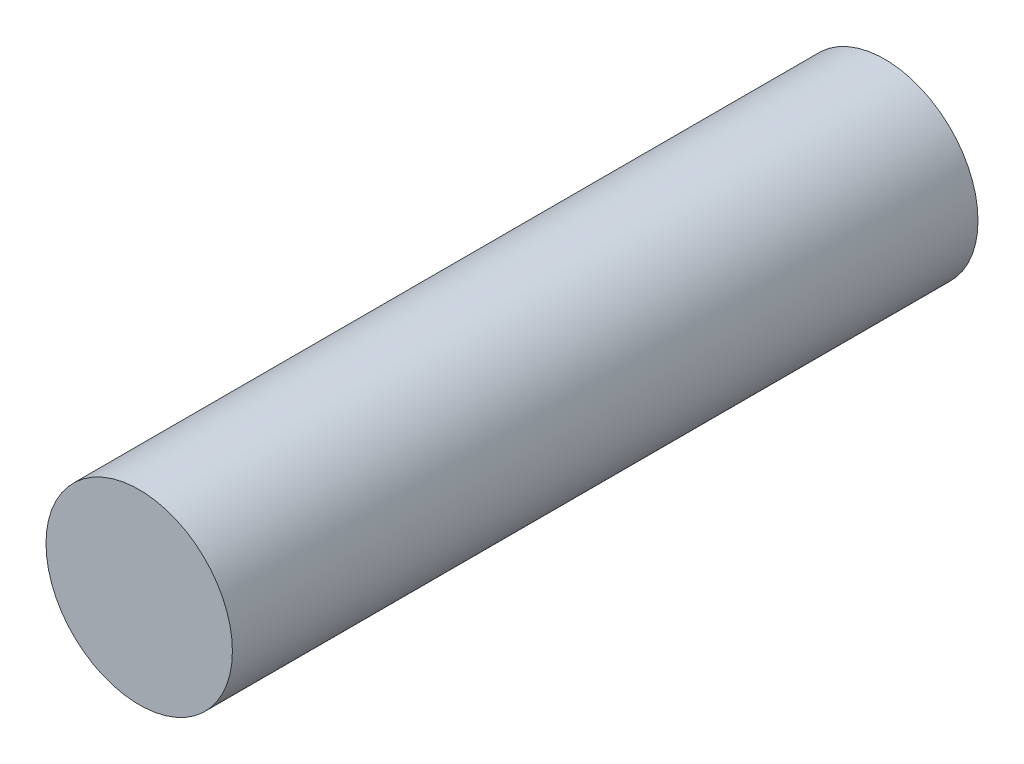
ISO-10303-21;
HEADER;
FILE_DESCRIPTION(('STEP AP214'),'2;1');
FILE_NAME('part.step','',(''),(''),'','','');
FILE_SCHEMA(('AUTOMOTIVE_DESIGN { 1 0 10303 214 1 1 1 1 }'));
ENDSEC;
DATA;
#1=APPLICATION_CONTEXT('core data for automotive mechanical design processes');
#2=APPLICATION_PROTOCOL_DEFINITION('international standard','automotive_design',2000,#1);
#3=PRODUCT_CONTEXT('',#1,'mechanical');
#4=PRODUCT('Part','Part','',(#3));
#5=PRODUCT_RELATED_PRODUCT_CATEGORY('part','',(#4));
#6=PRODUCT_DEFINITION_FORMATION('','',#4);
#7=PRODUCT_DEFINITION_CONTEXT('part definition',#1,'design');
#8=PRODUCT_DEFINITION('design','',#6,#7);
#9=PRODUCT_DEFINITION_SHAPE('','',#8);
#10=(LENGTH_UNIT() NAMED_UNIT(*) SI_UNIT(.MILLI.,.METRE.));
#11=(NAMED_UNIT(*) PLANE_ANGLE_UNIT() SI_UNIT($,.RADIAN.));
#12=(NAMED_UNIT(*) SI_UNIT($,.STERADIAN.) SOLID_ANGLE_UNIT());
#13=UNCERTAINTY_MEASURE_WITH_UNIT(LENGTH_MEASURE(1.E-05),#10,'distance_accuracy_value','');
#14=(GEOMETRIC_REPRESENTATION_CONTEXT(3) GLOBAL_UNCERTAINTY_ASSIGNED_CONTEXT((#13)) GLOBAL_UNIT_ASSIGNED_CONTEXT((#10,
#11,#12)) REPRESENTATION_CONTEXT('',''));
#15=CARTESIAN_POINT('',(0.,0.,0.));
#16=DIRECTION('',(0.,0.,1.));
#17=DIRECTION('',(1.,0.,0.));
#18=AXIS2_PLACEMENT_3D('',#15,#16,#17);
#19=CARTESIAN_POINT('',(0.,0.,38.1));
#20=DIRECTION('',(0.,0.,-1.));
#21=DIRECTION('',(-1.,0.,0.));
#22=AXIS2_PLACEMENT_3D('',#19,#20,#21);
#23=CYLINDRICAL_SURFACE('',#22,4.7625);
#24=CARTESIAN_POINT('',(0.,0.,38.1));
#25=DIRECTION('',(0.,0.,1.));
#26=DIRECTION('',(1.,0.,0.));
#27=AXIS2_PLACEMENT_3D('',#24,#25,#26);
#28=CIRCLE('',#27,4.7625);
#29=CARTESIAN_POINT('',(4.7625,0.,38.1));
#30=VERTEX_POINT('',#29);
#31=EDGE_CURVE('E12',#30,#30,#28,.T.);
#32=ORIENTED_EDGE('',*,*,#31,.F.);
#33=EDGE_LOOP('',(#32));
#34=FACE_BOUND('',#33,.T.);
#35=CARTESIAN_POINT('',(0.,0.,0.));
#36=DIRECTION('',(0.,0.,1.));
#37=DIRECTION('',(1.,0.,0.));
#38=AXIS2_PLACEMENT_3D('',#35,#36,#37);
#39=CIRCLE('',#38,4.7625);
#40=CARTESIAN_POINT('',(4.7625,0.,0.));
#41=VERTEX_POINT('',#40);
#42=EDGE_CURVE('E49',#41,#41,#39,.T.);
#43=ORIENTED_EDGE('',*,*,#42,.T.);
#44=EDGE_LOOP('',(#43));
#45=FACE_BOUND('',#44,.T.);
#46=ADVANCED_FACE('F43',(#34,#45),#23,.T.);
#47=CARTESIAN_POINT('',(0.,0.,38.1));
#48=DIRECTION('',(0.,0.,1.));
#49=DIRECTION('',(1.,0.,0.));
#50=AXIS2_PLACEMENT_3D('',#47,#48,#49);
#51=PLANE('',#50);
#52=ORIENTED_EDGE('',*,*,#31,.T.);
#53=EDGE_LOOP('',(#52));
#54=FACE_BOUND('',#53,.T.);
#55=ADVANCED_FACE('F58',(#54),#51,.T.);
#56=CARTESIAN_POINT('',(0.,0.,0.));
#57=DIRECTION('',(0.,0.,1.));
#58=DIRECTION('',(1.,0.,0.));
#59=AXIS2_PLACEMENT_3D('',#56,#57,#58);
#60=PLANE('',#59);
#61=ORIENTED_EDGE('',*,*,#42,.F.);
#62=EDGE_LOOP('',(#61));
#63=FACE_BOUND('',#62,.T.);
#64=ADVANCED_FACE('F56',(#63),#60,.F.);
#65=CLOSED_SHELL('',(#46,#55,#64));
#66=MANIFOLD_SOLID_BREP('B2',#65);
#67=ADVANCED_BREP_SHAPE_REPRESENTATION('',(#18,#66),#14);
#68=SHAPE_DEFINITION_REPRESENTATION(#9,#67);
ENDSEC;
END-ISO-10303-21;
